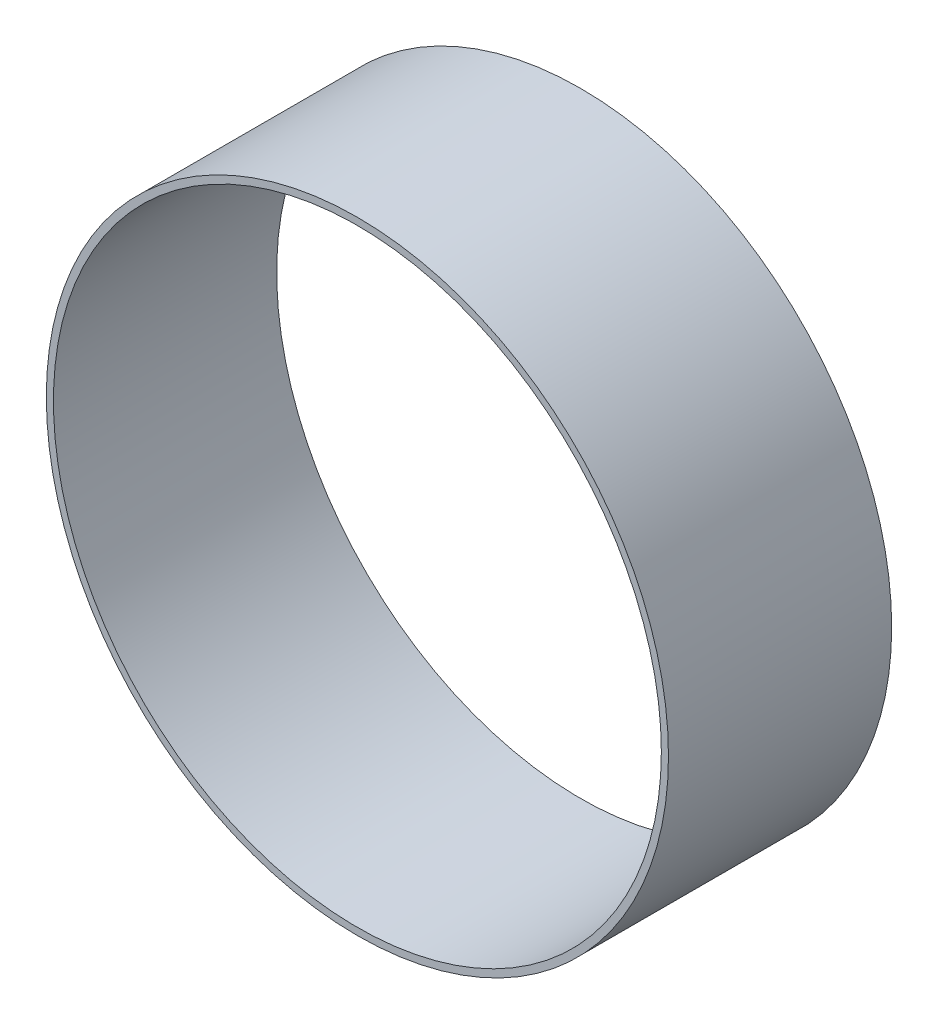
ISO-10303-21;
HEADER;
FILE_DESCRIPTION(('STEP AP214'),'2;1');
FILE_NAME('part.step','',(''),(''),'','','');
FILE_SCHEMA(('AUTOMOTIVE_DESIGN { 1 0 10303 214 1 1 1 1 }'));
ENDSEC;
DATA;
#1=APPLICATION_CONTEXT('core data for automotive mechanical design processes');
#2=APPLICATION_PROTOCOL_DEFINITION('international standard','automotive_design',2000,#1);
#3=PRODUCT_CONTEXT('',#1,'mechanical');
#4=PRODUCT('Part','Part','',(#3));
#5=PRODUCT_RELATED_PRODUCT_CATEGORY('part','',(#4));
#6=PRODUCT_DEFINITION_FORMATION('','',#4);
#7=PRODUCT_DEFINITION_CONTEXT('part definition',#1,'design');
#8=PRODUCT_DEFINITION('design','',#6,#7);
#9=PRODUCT_DEFINITION_SHAPE('','',#8);
#10=(LENGTH_UNIT() NAMED_UNIT(*) SI_UNIT(.MILLI.,.METRE.));
#11=(NAMED_UNIT(*) PLANE_ANGLE_UNIT() SI_UNIT($,.RADIAN.));
#12=(NAMED_UNIT(*) SI_UNIT($,.STERADIAN.) SOLID_ANGLE_UNIT());
#13=UNCERTAINTY_MEASURE_WITH_UNIT(LENGTH_MEASURE(1.E-05),#10,'distance_accuracy_value','');
#14=(GEOMETRIC_REPRESENTATION_CONTEXT(3) GLOBAL_UNCERTAINTY_ASSIGNED_CONTEXT((#13)) GLOBAL_UNIT_ASSIGNED_CONTEXT((#10,
#11,#12)) REPRESENTATION_CONTEXT('',''));
#15=CARTESIAN_POINT('',(0.,0.,0.));
#16=DIRECTION('',(0.,0.,1.));
#17=DIRECTION('',(1.,0.,0.));
#18=AXIS2_PLACEMENT_3D('',#15,#16,#17);
#19=CARTESIAN_POINT('',(0.,0.,74.6125));
#20=DIRECTION('',(0.,0.,1.));
#21=DIRECTION('',(1.,0.,0.));
#22=AXIS2_PLACEMENT_3D('',#19,#20,#21);
#23=PLANE('',#22);
#24=CARTESIAN_POINT('',(0.,0.,74.6125));
#25=DIRECTION('',(0.,0.,1.));
#26=DIRECTION('',(1.,0.,0.));
#27=AXIS2_PLACEMENT_3D('',#24,#25,#26);
#28=CIRCLE('',#27,207.9625);
#29=CARTESIAN_POINT('',(207.9625,0.,74.6125));
#30=VERTEX_POINT('',#29);
#31=EDGE_CURVE('E10',#30,#30,#28,.T.);
#32=ORIENTED_EDGE('',*,*,#31,.T.);
#33=EDGE_LOOP('',(#32));
#34=FACE_BOUND('',#33,.T.);
#35=CARTESIAN_POINT('',(0.,0.,74.6125));
#36=DIRECTION('',(0.,0.,1.));
#37=DIRECTION('',(1.,0.,0.));
#38=AXIS2_PLACEMENT_3D('',#35,#36,#37);
#39=CIRCLE('',#38,203.2);
#40=CARTESIAN_POINT('',(203.2,0.,74.6125));
#41=VERTEX_POINT('',#40);
#42=EDGE_CURVE('E43',#41,#41,#39,.T.);
#43=ORIENTED_EDGE('',*,*,#42,.F.);
#44=EDGE_LOOP('',(#43));
#45=FACE_BOUND('',#44,.T.);
#46=ADVANCED_FACE('F32',(#34,#45),#23,.T.);
#47=CARTESIAN_POINT('',(0.,0.,-74.6125));
#48=DIRECTION('',(0.,0.,1.));
#49=DIRECTION('',(1.,0.,0.));
#50=AXIS2_PLACEMENT_3D('',#47,#48,#49);
#51=PLANE('',#50);
#52=CARTESIAN_POINT('',(0.,0.,-74.6125));
#53=DIRECTION('',(0.,0.,1.));
#54=DIRECTION('',(1.,0.,0.));
#55=AXIS2_PLACEMENT_3D('',#52,#53,#54);
#56=CIRCLE('',#55,207.9625);
#57=CARTESIAN_POINT('',(207.9625,0.,-74.6125));
#58=VERTEX_POINT('',#57);
#59=EDGE_CURVE('E36',#58,#58,#56,.T.);
#60=ORIENTED_EDGE('',*,*,#59,.F.);
#61=EDGE_LOOP('',(#60));
#62=FACE_BOUND('',#61,.T.);
#63=CARTESIAN_POINT('',(0.,0.,-74.6125));
#64=DIRECTION('',(0.,0.,1.));
#65=DIRECTION('',(1.,0.,0.));
#66=AXIS2_PLACEMENT_3D('',#63,#64,#65);
#67=CIRCLE('',#66,203.2);
#68=CARTESIAN_POINT('',(203.2,0.,-74.6125));
#69=VERTEX_POINT('',#68);
#70=EDGE_CURVE('E45',#69,#69,#67,.T.);
#71=ORIENTED_EDGE('',*,*,#70,.T.);
#72=EDGE_LOOP('',(#71));
#73=FACE_BOUND('',#72,.T.);
#74=ADVANCED_FACE('F55',(#62,#73),#51,.F.);
#75=CARTESIAN_POINT('',(0.,0.,74.6125));
#76=DIRECTION('',(0.,0.,-1.));
#77=DIRECTION('',(-1.,0.,0.));
#78=AXIS2_PLACEMENT_3D('',#75,#76,#77);
#79=CYLINDRICAL_SURFACE('',#78,207.9625);
#80=ORIENTED_EDGE('',*,*,#31,.F.);
#81=EDGE_LOOP('',(#80));
#82=FACE_BOUND('',#81,.T.);
#83=ORIENTED_EDGE('',*,*,#59,.T.);
#84=EDGE_LOOP('',(#83));
#85=FACE_BOUND('',#84,.T.);
#86=ADVANCED_FACE('F34',(#82,#85),#79,.T.);
#87=CARTESIAN_POINT('',(0.,0.,74.6125));
#88=DIRECTION('',(0.,0.,-1.));
#89=DIRECTION('',(-1.,0.,0.));
#90=AXIS2_PLACEMENT_3D('',#87,#88,#89);
#91=CYLINDRICAL_SURFACE('',#90,203.2);
#92=ORIENTED_EDGE('',*,*,#42,.T.);
#93=EDGE_LOOP('',(#92));
#94=FACE_BOUND('',#93,.T.);
#95=ORIENTED_EDGE('',*,*,#70,.F.);
#96=EDGE_LOOP('',(#95));
#97=FACE_BOUND('',#96,.T.);
#98=ADVANCED_FACE('F51',(#94,#97),#91,.F.);
#99=CLOSED_SHELL('',(#46,#74,#86,#98));
#100=MANIFOLD_SOLID_BREP('B2',#99);
#101=ADVANCED_BREP_SHAPE_REPRESENTATION('',(#18,#100),#14);
#102=SHAPE_DEFINITION_REPRESENTATION(#9,#101);
ENDSEC;
END-ISO-10303-21;
